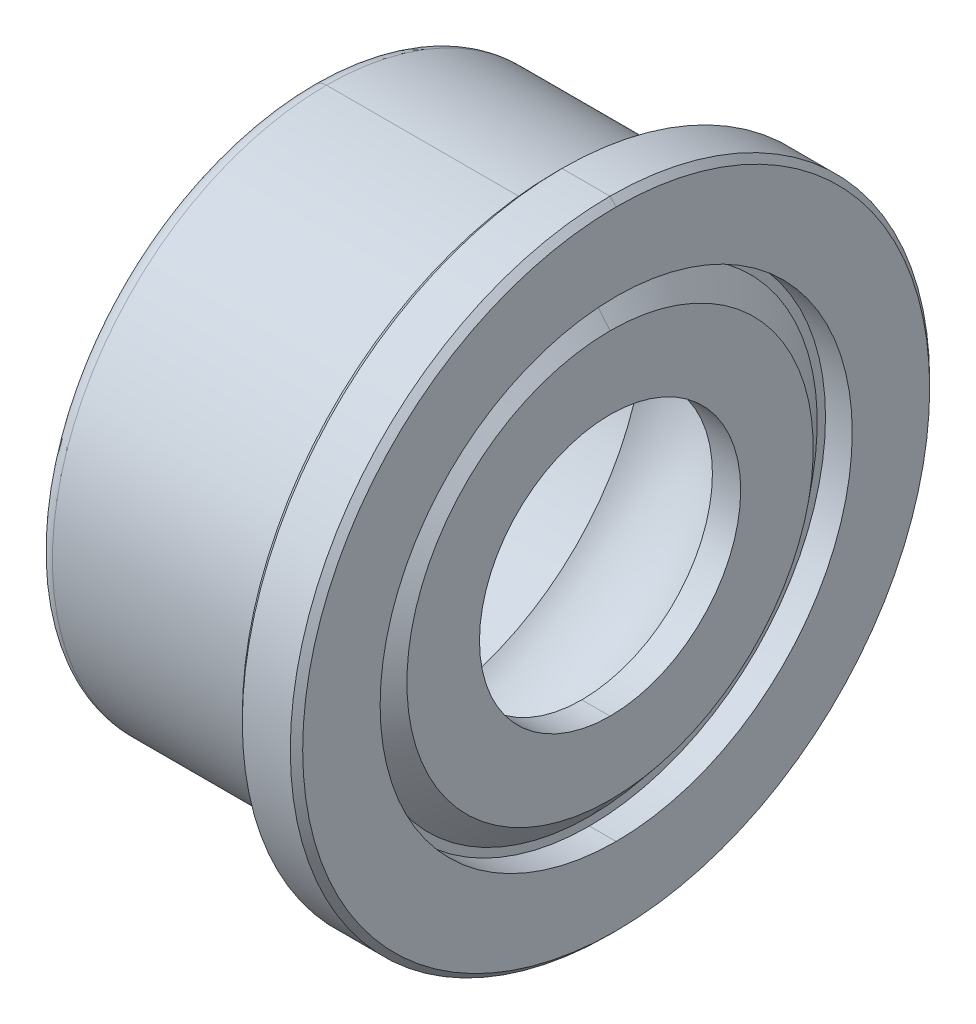
ISO-10303-21;
HEADER;
FILE_DESCRIPTION(('STEP AP214'),'2;1');
FILE_NAME('part.step','',(''),(''),'','','');
FILE_SCHEMA(('AUTOMOTIVE_DESIGN { 1 0 10303 214 1 1 1 1 }'));
ENDSEC;
DATA;
#1=APPLICATION_CONTEXT('core data for automotive mechanical design processes');
#2=APPLICATION_PROTOCOL_DEFINITION('international standard','automotive_design',2000,#1);
#3=PRODUCT_CONTEXT('',#1,'mechanical');
#4=PRODUCT('Part','Part','',(#3));
#5=PRODUCT_RELATED_PRODUCT_CATEGORY('part','',(#4));
#6=PRODUCT_DEFINITION_FORMATION('','',#4);
#7=PRODUCT_DEFINITION_CONTEXT('part definition',#1,'design');
#8=PRODUCT_DEFINITION('design','',#6,#7);
#9=PRODUCT_DEFINITION_SHAPE('','',#8);
#10=(LENGTH_UNIT() NAMED_UNIT(*) SI_UNIT(.MILLI.,.METRE.));
#11=(NAMED_UNIT(*) PLANE_ANGLE_UNIT() SI_UNIT($,.RADIAN.));
#12=(NAMED_UNIT(*) SI_UNIT($,.STERADIAN.) SOLID_ANGLE_UNIT());
#13=UNCERTAINTY_MEASURE_WITH_UNIT(LENGTH_MEASURE(1.E-05),#10,'distance_accuracy_value','');
#14=(GEOMETRIC_REPRESENTATION_CONTEXT(3) GLOBAL_UNCERTAINTY_ASSIGNED_CONTEXT((#13)) GLOBAL_UNIT_ASSIGNED_CONTEXT((#10,
#11,#12)) REPRESENTATION_CONTEXT('',''));
#15=CARTESIAN_POINT('',(0.,0.,0.));
#16=DIRECTION('',(0.,0.,1.));
#17=DIRECTION('',(1.,0.,0.));
#18=AXIS2_PLACEMENT_3D('',#15,#16,#17);
#19=CARTESIAN_POINT('',(-2.75209,0.,0.));
#20=DIRECTION('',(1.,0.,0.));
#21=DIRECTION('',(0.,-1.,0.));
#22=AXIS2_PLACEMENT_3D('',#19,#20,#21);
#23=CYLINDRICAL_SURFACE('',#22,3.872865);
#24=DIRECTION('',(1.,0.,0.));
#25=VECTOR('',#24,1.);
#26=CARTESIAN_POINT('',(0.893356989268567,3.872865,0.));
#27=LINE('',#26,#25);
#28=CARTESIAN_POINT('',(0.893356989268568,3.872865,0.));
#29=VERTEX_POINT('',#28);
#30=CARTESIAN_POINT('',(1.93804322400718,3.872865,0.));
#31=VERTEX_POINT('',#30);
#32=EDGE_CURVE('E19',#29,#31,#27,.T.);
#33=ORIENTED_EDGE('',*,*,#32,.F.);
#34=CARTESIAN_POINT('',(0.893356989268566,0.,0.));
#35=DIRECTION('',(-1.,0.,0.));
#36=DIRECTION('',(0.,1.,0.));
#37=AXIS2_PLACEMENT_3D('',#34,#35,#36);
#38=CIRCLE('',#37,3.872865);
#39=CARTESIAN_POINT('',(0.893356989268568,-3.872865,0.));
#40=VERTEX_POINT('',#39);
#41=EDGE_CURVE('E284',#29,#40,#38,.T.);
#42=ORIENTED_EDGE('',*,*,#41,.T.);
#43=DIRECTION('',(1.,0.,0.));
#44=VECTOR('',#43,1.);
#45=CARTESIAN_POINT('',(0.893356989268567,-3.872865,0.));
#46=LINE('',#45,#44);
#47=CARTESIAN_POINT('',(1.93804322400718,-3.872865,0.));
#48=VERTEX_POINT('',#47);
#49=EDGE_CURVE('E24',#40,#48,#46,.T.);
#50=ORIENTED_EDGE('',*,*,#49,.T.);
#51=CARTESIAN_POINT('',(1.93804322400718,0.,0.));
#52=DIRECTION('',(1.,0.,0.));
#53=DIRECTION('',(0.,-1.,0.));
#54=AXIS2_PLACEMENT_3D('',#51,#52,#53);
#55=CIRCLE('',#54,3.872865);
#56=EDGE_CURVE('E11',#48,#31,#55,.T.);
#57=ORIENTED_EDGE('',*,*,#56,.T.);
#58=EDGE_LOOP('',(#33,#42,#50,#57));
#59=FACE_BOUND('',#58,.T.);
#60=ADVANCED_FACE('F16',(#59),#23,.F.);
#61=CARTESIAN_POINT('',(1.93804322400718,0.,0.));
#62=DIRECTION('',(1.,0.,0.));
#63=DIRECTION('',(0.,-1.,0.));
#64=AXIS2_PLACEMENT_3D('',#61,#62,#63);
#65=PLANE('',#64);
#66=CARTESIAN_POINT('',(1.93804322400718,0.,0.));
#67=DIRECTION('',(-1.,0.,0.));
#68=DIRECTION('',(0.,1.,0.));
#69=AXIS2_PLACEMENT_3D('',#66,#67,#68);
#70=CIRCLE('',#69,2.14275035);
#71=CARTESIAN_POINT('',(1.93804322400718,2.14275035,0.));
#72=VERTEX_POINT('',#71);
#73=CARTESIAN_POINT('',(1.93804322400718,-2.14275035,0.));
#74=VERTEX_POINT('',#73);
#75=EDGE_CURVE('E844',#72,#74,#70,.T.);
#76=ORIENTED_EDGE('',*,*,#75,.F.);
#77=CARTESIAN_POINT('',(1.93804322400718,0.,0.));
#78=DIRECTION('',(1.,0.,0.));
#79=DIRECTION('',(0.,1.,0.));
#80=AXIS2_PLACEMENT_3D('',#77,#78,#79);
#81=CIRCLE('',#80,2.14275035);
#82=EDGE_CURVE('E846',#72,#74,#81,.T.);
#83=ORIENTED_EDGE('',*,*,#82,.T.);
#84=EDGE_LOOP('',(#76,#83));
#85=FACE_BOUND('',#84,.T.);
#86=ORIENTED_EDGE('',*,*,#56,.F.);
#87=CARTESIAN_POINT('',(1.93804322400718,0.,0.));
#88=DIRECTION('',(1.,0.,0.));
#89=DIRECTION('',(0.,1.,0.));
#90=AXIS2_PLACEMENT_3D('',#87,#88,#89);
#91=CIRCLE('',#90,3.872865);
#92=EDGE_CURVE('E293',#31,#48,#91,.T.);
#93=ORIENTED_EDGE('',*,*,#92,.F.);
#94=EDGE_LOOP('',(#86,#93));
#95=FACE_BOUND('',#94,.T.);
#96=ADVANCED_FACE('F335',(#85,#95),#65,.F.);
#97=CARTESIAN_POINT('',(-2.75209,0.,0.));
#98=DIRECTION('',(1.,0.,0.));
#99=DIRECTION('',(0.,-1.,0.));
#100=AXIS2_PLACEMENT_3D('',#97,#98,#99);
#101=CYLINDRICAL_SURFACE('',#100,3.872865);
#102=ORIENTED_EDGE('',*,*,#49,.F.);
#103=CARTESIAN_POINT('',(0.893356989268566,0.,0.));
#104=DIRECTION('',(1.,0.,0.));
#105=DIRECTION('',(0.,1.,0.));
#106=AXIS2_PLACEMENT_3D('',#103,#104,#105);
#107=CIRCLE('',#106,3.872865);
#108=EDGE_CURVE('E288',#29,#40,#107,.T.);
#109=ORIENTED_EDGE('',*,*,#108,.F.);
#110=ORIENTED_EDGE('',*,*,#32,.T.);
#111=ORIENTED_EDGE('',*,*,#92,.T.);
#112=EDGE_LOOP('',(#102,#109,#110,#111));
#113=FACE_BOUND('',#112,.T.);
#114=ADVANCED_FACE('F307',(#113),#101,.F.);
#115=CARTESIAN_POINT('',(0.,0.,0.));
#116=DIRECTION('',(1.,0.,0.));
#117=DIRECTION('',(0.,-1.,0.));
#118=AXIS2_PLACEMENT_3D('',#115,#116,#117);
#119=TOROIDAL_SURFACE('',#118,2.9972,1.25095);
#120=ORIENTED_EDGE('',*,*,#108,.T.);
#121=CARTESIAN_POINT('',(0.,-2.9972,0.));
#122=DIRECTION('',(0.,0.,1.));
#123=DIRECTION('',(-0.714142842854285,-0.7,0.));
#124=AXIS2_PLACEMENT_3D('',#121,#122,#123);
#125=CIRCLE('',#124,1.25095);
#126=CARTESIAN_POINT('',(-0.893356989268568,-3.872865,0.));
#127=VERTEX_POINT('',#126);
#128=EDGE_CURVE('E285',#127,#40,#125,.T.);
#129=ORIENTED_EDGE('',*,*,#128,.F.);
#130=CARTESIAN_POINT('',(-0.893356989268568,0.,0.));
#131=DIRECTION('',(1.,0.,0.));
#132=DIRECTION('',(0.,1.,0.));
#133=AXIS2_PLACEMENT_3D('',#130,#131,#132);
#134=CIRCLE('',#133,3.872865);
#135=CARTESIAN_POINT('',(-0.893356989268568,3.872865,0.));
#136=VERTEX_POINT('',#135);
#137=EDGE_CURVE('E278',#136,#127,#134,.T.);
#138=ORIENTED_EDGE('',*,*,#137,.F.);
#139=CARTESIAN_POINT('',(0.,2.9972,0.));
#140=DIRECTION('',(0.,0.,-1.));
#141=DIRECTION('',(-0.714142842854285,0.7,0.));
#142=AXIS2_PLACEMENT_3D('',#139,#140,#141);
#143=CIRCLE('',#142,1.25095);
#144=EDGE_CURVE('E281',#136,#29,#143,.T.);
#145=ORIENTED_EDGE('',*,*,#144,.T.);
#146=EDGE_LOOP('',(#120,#129,#138,#145));
#147=FACE_BOUND('',#146,.T.);
#148=ADVANCED_FACE('F310',(#147),#119,.F.);
#149=CARTESIAN_POINT('',(0.,0.,0.));
#150=DIRECTION('',(1.,0.,0.));
#151=DIRECTION('',(0.,-1.,0.));
#152=AXIS2_PLACEMENT_3D('',#149,#150,#151);
#153=TOROIDAL_SURFACE('',#152,2.9972,1.25095);
#154=CARTESIAN_POINT('',(-0.893356989268568,0.,0.));
#155=DIRECTION('',(-1.,0.,0.));
#156=DIRECTION('',(0.,1.,0.));
#157=AXIS2_PLACEMENT_3D('',#154,#155,#156);
#158=CIRCLE('',#157,3.872865);
#159=EDGE_CURVE('E277',#136,#127,#158,.T.);
#160=ORIENTED_EDGE('',*,*,#159,.T.);
#161=ORIENTED_EDGE('',*,*,#128,.T.);
#162=ORIENTED_EDGE('',*,*,#41,.F.);
#163=ORIENTED_EDGE('',*,*,#144,.F.);
#164=EDGE_LOOP('',(#160,#161,#162,#163));
#165=FACE_BOUND('',#164,.T.);
#166=ADVANCED_FACE('F311',(#165),#153,.F.);
#167=CARTESIAN_POINT('',(-2.75209,0.,0.));
#168=DIRECTION('',(1.,0.,0.));
#169=DIRECTION('',(0.,-1.,0.));
#170=AXIS2_PLACEMENT_3D('',#167,#168,#169);
#171=CYLINDRICAL_SURFACE('',#170,3.872865);
#172=DIRECTION('',(1.,0.,0.));
#173=VECTOR('',#172,1.);
#174=CARTESIAN_POINT('',(-1.93804322400718,-3.872865,0.));
#175=LINE('',#174,#173);
#176=CARTESIAN_POINT('',(-1.93804322400718,-3.872865,0.));
#177=VERTEX_POINT('',#176);
#178=EDGE_CURVE('E273',#177,#127,#175,.T.);
#179=ORIENTED_EDGE('',*,*,#178,.T.);
#180=ORIENTED_EDGE('',*,*,#159,.F.);
#181=DIRECTION('',(1.,0.,0.));
#182=VECTOR('',#181,1.);
#183=CARTESIAN_POINT('',(-1.93804322400718,3.872865,0.));
#184=LINE('',#183,#182);
#185=CARTESIAN_POINT('',(-1.93804322400718,3.872865,0.));
#186=VERTEX_POINT('',#185);
#187=EDGE_CURVE('E274',#186,#136,#184,.T.);
#188=ORIENTED_EDGE('',*,*,#187,.F.);
#189=CARTESIAN_POINT('',(-1.93804322400718,0.,0.));
#190=DIRECTION('',(1.,0.,0.));
#191=DIRECTION('',(0.,-1.,0.));
#192=AXIS2_PLACEMENT_3D('',#189,#190,#191);
#193=CIRCLE('',#192,3.872865);
#194=EDGE_CURVE('E270',#177,#186,#193,.T.);
#195=ORIENTED_EDGE('',*,*,#194,.F.);
#196=EDGE_LOOP('',(#179,#180,#188,#195));
#197=FACE_BOUND('',#196,.T.);
#198=ADVANCED_FACE('F315',(#197),#171,.F.);
#199=CARTESIAN_POINT('',(-2.75209,0.,0.));
#200=DIRECTION('',(1.,0.,0.));
#201=DIRECTION('',(0.,-1.,0.));
#202=AXIS2_PLACEMENT_3D('',#199,#200,#201);
#203=CYLINDRICAL_SURFACE('',#202,3.872865);
#204=ORIENTED_EDGE('',*,*,#187,.T.);
#205=ORIENTED_EDGE('',*,*,#137,.T.);
#206=ORIENTED_EDGE('',*,*,#178,.F.);
#207=CARTESIAN_POINT('',(-1.93804322400718,0.,0.));
#208=DIRECTION('',(1.,0.,0.));
#209=DIRECTION('',(0.,1.,0.));
#210=AXIS2_PLACEMENT_3D('',#207,#208,#209);
#211=CIRCLE('',#210,3.872865);
#212=EDGE_CURVE('E265',#186,#177,#211,.T.);
#213=ORIENTED_EDGE('',*,*,#212,.F.);
#214=EDGE_LOOP('',(#204,#205,#206,#213));
#215=FACE_BOUND('',#214,.T.);
#216=ADVANCED_FACE('F318',(#215),#203,.F.);
#217=CARTESIAN_POINT('',(-1.93804322400718,0.,0.));
#218=DIRECTION('',(1.,0.,0.));
#219=DIRECTION('',(0.,-1.,0.));
#220=AXIS2_PLACEMENT_3D('',#217,#218,#219);
#221=PLANE('',#220);
#222=CARTESIAN_POINT('',(-1.93804322400718,0.,0.));
#223=DIRECTION('',(1.,0.,0.));
#224=DIRECTION('',(0.,1.,0.));
#225=AXIS2_PLACEMENT_3D('',#222,#223,#224);
#226=CIRCLE('',#225,2.14275035);
#227=CARTESIAN_POINT('',(-1.93804322400718,2.14275035,0.));
#228=VERTEX_POINT('',#227);
#229=CARTESIAN_POINT('',(-1.93804322400718,-2.14275035,0.));
#230=VERTEX_POINT('',#229);
#231=EDGE_CURVE('E261',#228,#230,#226,.T.);
#232=ORIENTED_EDGE('',*,*,#231,.F.);
#233=CARTESIAN_POINT('',(-1.93804322400718,0.,0.));
#234=DIRECTION('',(-1.,0.,0.));
#235=DIRECTION('',(0.,1.,0.));
#236=AXIS2_PLACEMENT_3D('',#233,#234,#235);
#237=CIRCLE('',#236,2.14275035);
#238=EDGE_CURVE('E263',#228,#230,#237,.T.);
#239=ORIENTED_EDGE('',*,*,#238,.T.);
#240=EDGE_LOOP('',(#232,#239));
#241=FACE_BOUND('',#240,.T.);
#242=ORIENTED_EDGE('',*,*,#194,.T.);
#243=ORIENTED_EDGE('',*,*,#212,.T.);
#244=EDGE_LOOP('',(#242,#243));
#245=FACE_BOUND('',#244,.T.);
#246=ADVANCED_FACE('F320',(#241,#245),#221,.T.);
#247=CARTESIAN_POINT('',(-2.6420064,0.,0.));
#248=DIRECTION('',(1.,0.,0.));
#249=DIRECTION('',(0.,-1.,0.));
#250=AXIS2_PLACEMENT_3D('',#247,#248,#249);
#251=CYLINDRICAL_SURFACE('',#250,2.14275035);
#252=CARTESIAN_POINT('',(-2.401824,0.,0.));
#253=DIRECTION('',(-1.,0.,0.));
#254=DIRECTION('',(0.,1.,0.));
#255=AXIS2_PLACEMENT_3D('',#252,#253,#254);
#256=CIRCLE('',#255,2.14275035);
#257=CARTESIAN_POINT('',(-2.401824,2.14275035,0.));
#258=VERTEX_POINT('',#257);
#259=CARTESIAN_POINT('',(-2.401824,-2.14275035,0.));
#260=VERTEX_POINT('',#259);
#261=EDGE_CURVE('E254',#258,#260,#256,.T.);
#262=ORIENTED_EDGE('',*,*,#261,.T.);
#263=DIRECTION('',(1.,0.,0.));
#264=VECTOR('',#263,1.);
#265=CARTESIAN_POINT('',(-2.401824,-2.14275035,0.));
#266=LINE('',#265,#264);
#267=EDGE_CURVE('E258',#260,#230,#266,.T.);
#268=ORIENTED_EDGE('',*,*,#267,.T.);
#269=ORIENTED_EDGE('',*,*,#238,.F.);
#270=DIRECTION('',(1.,0.,0.));
#271=VECTOR('',#270,1.);
#272=CARTESIAN_POINT('',(-2.401824,2.14275035,0.));
#273=LINE('',#272,#271);
#274=EDGE_CURVE('E255',#258,#228,#273,.T.);
#275=ORIENTED_EDGE('',*,*,#274,.F.);
#276=EDGE_LOOP('',(#262,#268,#269,#275));
#277=FACE_BOUND('',#276,.T.);
#278=ADVANCED_FACE('F322',(#277),#251,.F.);
#279=CARTESIAN_POINT('',(-2.6420064,0.,0.));
#280=DIRECTION('',(1.,0.,0.));
#281=DIRECTION('',(0.,-1.,0.));
#282=AXIS2_PLACEMENT_3D('',#279,#280,#281);
#283=CYLINDRICAL_SURFACE('',#282,2.14275035);
#284=ORIENTED_EDGE('',*,*,#231,.T.);
#285=ORIENTED_EDGE('',*,*,#267,.F.);
#286=CARTESIAN_POINT('',(-2.401824,0.,0.));
#287=DIRECTION('',(1.,0.,0.));
#288=DIRECTION('',(0.,1.,0.));
#289=AXIS2_PLACEMENT_3D('',#286,#287,#288);
#290=CIRCLE('',#289,2.14275035);
#291=EDGE_CURVE('E249',#258,#260,#290,.T.);
#292=ORIENTED_EDGE('',*,*,#291,.F.);
#293=ORIENTED_EDGE('',*,*,#274,.T.);
#294=EDGE_LOOP('',(#284,#285,#292,#293));
#295=FACE_BOUND('',#294,.T.);
#296=ADVANCED_FACE('F330',(#295),#283,.F.);
#297=CARTESIAN_POINT('',(-2.401824,0.,0.));
#298=DIRECTION('',(1.,0.,0.));
#299=DIRECTION('',(0.,-1.,0.));
#300=AXIS2_PLACEMENT_3D('',#297,#298,#299);
#301=PLANE('',#300);
#302=ORIENTED_EDGE('',*,*,#261,.F.);
#303=ORIENTED_EDGE('',*,*,#291,.T.);
#304=EDGE_LOOP('',(#302,#303));
#305=FACE_BOUND('',#304,.T.);
#306=CARTESIAN_POINT('',(-2.401824,0.,0.));
#307=DIRECTION('',(1.,0.,0.));
#308=DIRECTION('',(0.,1.,0.));
#309=AXIS2_PLACEMENT_3D('',#306,#307,#308);
#310=CIRCLE('',#309,3.3336847347);
#311=CARTESIAN_POINT('',(-2.401824,3.3336847347,0.));
#312=VERTEX_POINT('',#311);
#313=CARTESIAN_POINT('',(-2.401824,-3.3336847347,0.));
#314=VERTEX_POINT('',#313);
#315=EDGE_CURVE('E245',#312,#314,#310,.T.);
#316=ORIENTED_EDGE('',*,*,#315,.F.);
#317=CARTESIAN_POINT('',(-2.401824,0.,0.));
#318=DIRECTION('',(-1.,0.,0.));
#319=DIRECTION('',(0.,1.,0.));
#320=AXIS2_PLACEMENT_3D('',#317,#318,#319);
#321=CIRCLE('',#320,3.3336847347);
#322=EDGE_CURVE('E247',#312,#314,#321,.T.);
#323=ORIENTED_EDGE('',*,*,#322,.T.);
#324=EDGE_LOOP('',(#316,#323));
#325=FACE_BOUND('',#324,.T.);
#326=ADVANCED_FACE('F386',(#305,#325),#301,.F.);
#327=CARTESIAN_POINT('',(-2.41390058018481,0.,0.));
#328=DIRECTION('',(1.,0.,0.));
#329=DIRECTION('',(0.,-1.,0.));
#330=AXIS2_PLACEMENT_3D('',#327,#328,#329);
#331=CONICAL_SURFACE('',#330,3.3192924268785,0.872664625997165);
#332=CARTESIAN_POINT('',(-2.06313822400718,0.,0.));
#333=DIRECTION('',(-1.,0.,0.));
#334=DIRECTION('',(0.,1.,0.));
#335=AXIS2_PLACEMENT_3D('',#332,#333,#334);
#336=CIRCLE('',#335,3.737314725);
#337=CARTESIAN_POINT('',(-2.06313822400718,3.737314725,0.));
#338=VERTEX_POINT('',#337);
#339=CARTESIAN_POINT('',(-2.06313822400718,-3.737314725,0.));
#340=VERTEX_POINT('',#339);
#341=EDGE_CURVE('E238',#338,#340,#336,.T.);
#342=ORIENTED_EDGE('',*,*,#341,.T.);
#343=DIRECTION('',(-0.642787609686539,0.766044443118978,0.));
#344=VECTOR('',#343,1.);
#345=CARTESIAN_POINT('',(-2.06313822400718,-3.737314725,0.));
#346=LINE('',#345,#344);
#347=EDGE_CURVE('E242',#340,#314,#346,.T.);
#348=ORIENTED_EDGE('',*,*,#347,.T.);
#349=ORIENTED_EDGE('',*,*,#322,.F.);
#350=DIRECTION('',(-0.642787609686539,-0.766044443118978,0.));
#351=VECTOR('',#350,1.);
#352=CARTESIAN_POINT('',(-2.06313822400718,3.737314725,0.));
#353=LINE('',#352,#351);
#354=EDGE_CURVE('E239',#338,#312,#353,.T.);
#355=ORIENTED_EDGE('',*,*,#354,.F.);
#356=EDGE_LOOP('',(#342,#348,#349,#355));
#357=FACE_BOUND('',#356,.T.);
#358=ADVANCED_FACE('F397',(#357),#331,.T.);
#359=CARTESIAN_POINT('',(-2.41390058018481,0.,0.));
#360=DIRECTION('',(1.,0.,0.));
#361=DIRECTION('',(0.,-1.,0.));
#362=AXIS2_PLACEMENT_3D('',#359,#360,#361);
#363=CONICAL_SURFACE('',#362,3.3192924268785,0.872664625997165);
#364=ORIENTED_EDGE('',*,*,#315,.T.);
#365=ORIENTED_EDGE('',*,*,#347,.F.);
#366=CARTESIAN_POINT('',(-2.06313822400718,0.,0.));
#367=DIRECTION('',(1.,0.,0.));
#368=DIRECTION('',(0.,1.,0.));
#369=AXIS2_PLACEMENT_3D('',#366,#367,#368);
#370=CIRCLE('',#369,3.737314725);
#371=EDGE_CURVE('E230',#338,#340,#370,.T.);
#372=ORIENTED_EDGE('',*,*,#371,.F.);
#373=ORIENTED_EDGE('',*,*,#354,.T.);
#374=EDGE_LOOP('',(#364,#365,#372,#373));
#375=FACE_BOUND('',#374,.T.);
#376=ADVANCED_FACE('F408',(#375),#363,.T.);
#377=CARTESIAN_POINT('',(-2.75209,0.,0.));
#378=DIRECTION('',(1.,0.,0.));
#379=DIRECTION('',(0.,-1.,0.));
#380=AXIS2_PLACEMENT_3D('',#377,#378,#379);
#381=CYLINDRICAL_SURFACE('',#380,3.872865);
#382=DIRECTION('',(1.,0.,0.));
#383=VECTOR('',#382,1.);
#384=CARTESIAN_POINT('',(-2.5019,3.872865,0.));
#385=LINE('',#384,#383);
#386=CARTESIAN_POINT('',(-2.5019,3.872865,0.));
#387=VERTEX_POINT('',#386);
#388=CARTESIAN_POINT('',(-2.06313822400718,3.872865,0.));
#389=VERTEX_POINT('',#388);
#390=EDGE_CURVE('E224',#387,#389,#385,.T.);
#391=ORIENTED_EDGE('',*,*,#390,.F.);
#392=CARTESIAN_POINT('',(-2.5019,0.,0.));
#393=DIRECTION('',(-1.,0.,0.));
#394=DIRECTION('',(0.,1.,0.));
#395=AXIS2_PLACEMENT_3D('',#392,#393,#394);
#396=CIRCLE('',#395,3.872865);
#397=CARTESIAN_POINT('',(-2.5019,-3.872865,0.));
#398=VERTEX_POINT('',#397);
#399=EDGE_CURVE('E225',#387,#398,#396,.T.);
#400=ORIENTED_EDGE('',*,*,#399,.T.);
#401=DIRECTION('',(1.,0.,0.));
#402=VECTOR('',#401,1.);
#403=CARTESIAN_POINT('',(-2.5019,-3.872865,0.));
#404=LINE('',#403,#402);
#405=CARTESIAN_POINT('',(-2.06313822400718,-3.872865,0.));
#406=VERTEX_POINT('',#405);
#407=EDGE_CURVE('E231',#398,#406,#404,.T.);
#408=ORIENTED_EDGE('',*,*,#407,.T.);
#409=CARTESIAN_POINT('',(-2.06313822400718,0.,0.));
#410=DIRECTION('',(1.,0.,0.));
#411=DIRECTION('',(0.,-1.,0.));
#412=AXIS2_PLACEMENT_3D('',#409,#410,#411);
#413=CIRCLE('',#412,3.872865);
#414=EDGE_CURVE('E228',#406,#389,#413,.T.);
#415=ORIENTED_EDGE('',*,*,#414,.T.);
#416=EDGE_LOOP('',(#391,#400,#408,#415));
#417=FACE_BOUND('',#416,.T.);
#418=ADVANCED_FACE('F419',(#417),#381,.F.);
#419=CARTESIAN_POINT('',(-2.06313822400718,0.,0.));
#420=DIRECTION('',(1.,0.,0.));
#421=DIRECTION('',(0.,-1.,0.));
#422=AXIS2_PLACEMENT_3D('',#419,#420,#421);
#423=PLANE('',#422);
#424=ORIENTED_EDGE('',*,*,#341,.F.);
#425=ORIENTED_EDGE('',*,*,#371,.T.);
#426=EDGE_LOOP('',(#424,#425));
#427=FACE_BOUND('',#426,.T.);
#428=ORIENTED_EDGE('',*,*,#414,.F.);
#429=CARTESIAN_POINT('',(-2.06313822400718,0.,0.));
#430=DIRECTION('',(1.,0.,0.));
#431=DIRECTION('',(0.,1.,0.));
#432=AXIS2_PLACEMENT_3D('',#429,#430,#431);
#433=CIRCLE('',#432,3.872865);
#434=EDGE_CURVE('E221',#389,#406,#433,.T.);
#435=ORIENTED_EDGE('',*,*,#434,.F.);
#436=EDGE_LOOP('',(#428,#435));
#437=FACE_BOUND('',#436,.T.);
#438=ADVANCED_FACE('F430',(#427,#437),#423,.F.);
#439=CARTESIAN_POINT('',(-2.75209,0.,0.));
#440=DIRECTION('',(1.,0.,0.));
#441=DIRECTION('',(0.,-1.,0.));
#442=AXIS2_PLACEMENT_3D('',#439,#440,#441);
#443=CYLINDRICAL_SURFACE('',#442,3.872865);
#444=ORIENTED_EDGE('',*,*,#407,.F.);
#445=CARTESIAN_POINT('',(-2.5019,0.,0.));
#446=DIRECTION('',(1.,0.,0.));
#447=DIRECTION('',(0.,1.,0.));
#448=AXIS2_PLACEMENT_3D('',#445,#446,#447);
#449=CIRCLE('',#448,3.872865);
#450=EDGE_CURVE('E220',#387,#398,#449,.T.);
#451=ORIENTED_EDGE('',*,*,#450,.F.);
#452=ORIENTED_EDGE('',*,*,#390,.T.);
#453=ORIENTED_EDGE('',*,*,#434,.T.);
#454=EDGE_LOOP('',(#444,#451,#452,#453));
#455=FACE_BOUND('',#454,.T.);
#456=ADVANCED_FACE('F441',(#455),#443,.F.);
#457=CARTESIAN_POINT('',(-2.5019,0.,0.));
#458=DIRECTION('',(1.,0.,0.));
#459=DIRECTION('',(0.,-1.,0.));
#460=AXIS2_PLACEMENT_3D('',#457,#458,#459);
#461=PLANE('',#460);
#462=ORIENTED_EDGE('',*,*,#399,.F.);
#463=ORIENTED_EDGE('',*,*,#450,.T.);
#464=EDGE_LOOP('',(#462,#463));
#465=FACE_BOUND('',#464,.T.);
#466=CARTESIAN_POINT('',(-2.5019,0.,0.));
#467=DIRECTION('',(1.,0.,0.));
#468=DIRECTION('',(0.,1.,0.));
#469=AXIS2_PLACEMENT_3D('',#466,#467,#468);
#470=CIRCLE('',#469,4.24561);
#471=CARTESIAN_POINT('',(-2.5019,4.24561,0.));
#472=VERTEX_POINT('',#471);
#473=CARTESIAN_POINT('',(-2.5019,-4.24561,0.));
#474=VERTEX_POINT('',#473);
#475=EDGE_CURVE('E216',#472,#474,#470,.T.);
#476=ORIENTED_EDGE('',*,*,#475,.F.);
#477=CARTESIAN_POINT('',(-2.5019,0.,0.));
#478=DIRECTION('',(-1.,0.,0.));
#479=DIRECTION('',(0.,1.,0.));
#480=AXIS2_PLACEMENT_3D('',#477,#478,#479);
#481=CIRCLE('',#480,4.24561);
#482=EDGE_CURVE('E195',#472,#474,#481,.T.);
#483=ORIENTED_EDGE('',*,*,#482,.T.);
#484=EDGE_LOOP('',(#476,#483));
#485=FACE_BOUND('',#484,.T.);
#486=ADVANCED_FACE('F452',(#465,#485),#461,.F.);
#487=CARTESIAN_POINT('',(-2.25171,0.,0.));
#488=DIRECTION('',(1.,0.,0.));
#489=DIRECTION('',(0.,-1.,0.));
#490=AXIS2_PLACEMENT_3D('',#487,#488,#489);
#491=TOROIDAL_SURFACE('',#490,4.24561,0.25019);
#492=ORIENTED_EDGE('',*,*,#475,.T.);
#493=CARTESIAN_POINT('',(-2.25171,-4.24561,0.));
#494=DIRECTION('',(0.,0.,-1.));
#495=DIRECTION('',(0.,-1.,0.));
#496=AXIS2_PLACEMENT_3D('',#493,#494,#495);
#497=CIRCLE('',#496,0.25019);
#498=CARTESIAN_POINT('',(-2.25171,-4.4958,0.));
#499=VERTEX_POINT('',#498);
#500=EDGE_CURVE('E182',#499,#474,#497,.T.);
#501=ORIENTED_EDGE('',*,*,#500,.F.);
#502=CARTESIAN_POINT('',(-2.25171,0.,0.));
#503=DIRECTION('',(1.,0.,0.));
#504=DIRECTION('',(0.,1.,0.));
#505=AXIS2_PLACEMENT_3D('',#502,#503,#504);
#506=CIRCLE('',#505,4.4958);
#507=CARTESIAN_POINT('',(-2.25171,4.4958,0.));
#508=VERTEX_POINT('',#507);
#509=EDGE_CURVE('E175',#508,#499,#506,.T.);
#510=ORIENTED_EDGE('',*,*,#509,.F.);
#511=CARTESIAN_POINT('',(-2.25171,4.24561,0.));
#512=DIRECTION('',(0.,0.,1.));
#513=DIRECTION('',(0.,1.,0.));
#514=AXIS2_PLACEMENT_3D('',#511,#512,#513);
#515=CIRCLE('',#514,0.25019);
#516=EDGE_CURVE('E179',#508,#472,#515,.T.);
#517=ORIENTED_EDGE('',*,*,#516,.T.);
#518=EDGE_LOOP('',(#492,#501,#510,#517));
#519=FACE_BOUND('',#518,.T.);
#520=ADVANCED_FACE('F178',(#519),#491,.T.);
#521=CARTESIAN_POINT('',(-2.25171,0.,0.));
#522=DIRECTION('',(1.,0.,0.));
#523=DIRECTION('',(0.,-1.,0.));
#524=AXIS2_PLACEMENT_3D('',#521,#522,#523);
#525=TOROIDAL_SURFACE('',#524,4.24561,0.25019);
#526=CARTESIAN_POINT('',(-2.25171,0.,0.));
#527=DIRECTION('',(-1.,0.,0.));
#528=DIRECTION('',(0.,1.,0.));
#529=AXIS2_PLACEMENT_3D('',#526,#527,#528);
#530=CIRCLE('',#529,4.4958);
#531=EDGE_CURVE('E193',#508,#499,#530,.T.);
#532=ORIENTED_EDGE('',*,*,#531,.T.);
#533=ORIENTED_EDGE('',*,*,#500,.T.);
#534=ORIENTED_EDGE('',*,*,#482,.F.);
#535=ORIENTED_EDGE('',*,*,#516,.F.);
#536=EDGE_LOOP('',(#532,#533,#534,#535));
#537=FACE_BOUND('',#536,.T.);
#538=ADVANCED_FACE('F192',(#537),#525,.T.);
#539=CARTESIAN_POINT('',(1.3462,0.,0.));
#540=DIRECTION('',(1.,0.,0.));
#541=DIRECTION('',(0.,-1.,0.));
#542=AXIS2_PLACEMENT_3D('',#539,#540,#541);
#543=TOROIDAL_SURFACE('',#542,4.6609,0.1651);
#544=CARTESIAN_POINT('',(1.3462,4.6609,0.));
#545=DIRECTION('',(0.,0.,-1.));
#546=DIRECTION('',(1.,0.,0.));
#547=AXIS2_PLACEMENT_3D('',#544,#545,#546);
#548=CIRCLE('',#547,0.1651);
#549=CARTESIAN_POINT('',(1.5113,4.6609,0.));
#550=VERTEX_POINT('',#549);
#551=CARTESIAN_POINT('',(1.3462,4.4958,0.));
#552=VERTEX_POINT('',#551);
#553=EDGE_CURVE('E211',#550,#552,#548,.T.);
#554=ORIENTED_EDGE('',*,*,#553,.F.);
#555=CARTESIAN_POINT('',(1.5113,0.,0.));
#556=DIRECTION('',(-1.,0.,0.));
#557=DIRECTION('',(0.,1.,0.));
#558=AXIS2_PLACEMENT_3D('',#555,#556,#557);
#559=CIRCLE('',#558,4.6609);
#560=CARTESIAN_POINT('',(1.5113,-4.6609,0.));
#561=VERTEX_POINT('',#560);
#562=EDGE_CURVE('E212',#550,#561,#559,.T.);
#563=ORIENTED_EDGE('',*,*,#562,.T.);
#564=CARTESIAN_POINT('',(1.3462,-4.6609,0.));
#565=DIRECTION('',(0.,0.,1.));
#566=DIRECTION('',(1.,0.,0.));
#567=AXIS2_PLACEMENT_3D('',#564,#565,#566);
#568=CIRCLE('',#567,0.1651);
#569=CARTESIAN_POINT('',(1.3462,-4.4958,0.));
#570=VERTEX_POINT('',#569);
#571=EDGE_CURVE('E32',#561,#570,#568,.T.);
#572=ORIENTED_EDGE('',*,*,#571,.T.);
#573=CARTESIAN_POINT('',(1.3462,0.,0.));
#574=DIRECTION('',(1.,0.,0.));
#575=DIRECTION('',(0.,-1.,0.));
#576=AXIS2_PLACEMENT_3D('',#573,#574,#575);
#577=CIRCLE('',#576,4.4958);
#578=EDGE_CURVE('E36',#570,#552,#577,.T.);
#579=ORIENTED_EDGE('',*,*,#578,.T.);
#580=EDGE_LOOP('',(#554,#563,#572,#579));
#581=FACE_BOUND('',#580,.T.);
#582=ADVANCED_FACE('F482',(#581),#543,.F.);
#583=CARTESIAN_POINT('',(-2.75209,0.,0.));
#584=DIRECTION('',(1.,0.,0.));
#585=DIRECTION('',(0.,-1.,0.));
#586=AXIS2_PLACEMENT_3D('',#583,#584,#585);
#587=CYLINDRICAL_SURFACE('',#586,4.4958);
#588=DIRECTION('',(-1.,0.,0.));
#589=VECTOR('',#588,1.);
#590=CARTESIAN_POINT('',(1.3462,-4.4958,0.));
#591=LINE('',#590,#589);
#592=EDGE_CURVE('E188',#570,#499,#591,.T.);
#593=ORIENTED_EDGE('',*,*,#592,.T.);
#594=ORIENTED_EDGE('',*,*,#531,.F.);
#595=DIRECTION('',(-1.,0.,0.));
#596=VECTOR('',#595,1.);
#597=CARTESIAN_POINT('',(1.3462,4.4958,0.));
#598=LINE('',#597,#596);
#599=EDGE_CURVE('E187',#552,#508,#598,.T.);
#600=ORIENTED_EDGE('',*,*,#599,.F.);
#601=ORIENTED_EDGE('',*,*,#578,.F.);
#602=EDGE_LOOP('',(#593,#594,#600,#601));
#603=FACE_BOUND('',#602,.T.);
#604=ADVANCED_FACE('F198',(#603),#587,.T.);
#605=CARTESIAN_POINT('',(-2.75209,0.,0.));
#606=DIRECTION('',(1.,0.,0.));
#607=DIRECTION('',(0.,-1.,0.));
#608=AXIS2_PLACEMENT_3D('',#605,#606,#607);
#609=CYLINDRICAL_SURFACE('',#608,4.4958);
#610=ORIENTED_EDGE('',*,*,#599,.T.);
#611=ORIENTED_EDGE('',*,*,#509,.T.);
#612=ORIENTED_EDGE('',*,*,#592,.F.);
#613=CARTESIAN_POINT('',(1.3462,0.,0.));
#614=DIRECTION('',(1.,0.,0.));
#615=DIRECTION('',(0.,1.,0.));
#616=AXIS2_PLACEMENT_3D('',#613,#614,#615);
#617=CIRCLE('',#616,4.4958);
#618=EDGE_CURVE('E203',#552,#570,#617,.T.);
#619=ORIENTED_EDGE('',*,*,#618,.F.);
#620=EDGE_LOOP('',(#610,#611,#612,#619));
#621=FACE_BOUND('',#620,.T.);
#622=ADVANCED_FACE('F201',(#621),#609,.T.);
#623=CARTESIAN_POINT('',(1.3462,0.,0.));
#624=DIRECTION('',(1.,0.,0.));
#625=DIRECTION('',(0.,-1.,0.));
#626=AXIS2_PLACEMENT_3D('',#623,#624,#625);
#627=TOROIDAL_SURFACE('',#626,4.6609,0.1651);
#628=ORIENTED_EDGE('',*,*,#571,.F.);
#629=CARTESIAN_POINT('',(1.5113,0.,0.));
#630=DIRECTION('',(1.,0.,0.));
#631=DIRECTION('',(0.,1.,0.));
#632=AXIS2_PLACEMENT_3D('',#629,#630,#631);
#633=CIRCLE('',#632,4.6609);
#634=EDGE_CURVE('E214',#550,#561,#633,.T.);
#635=ORIENTED_EDGE('',*,*,#634,.F.);
#636=ORIENTED_EDGE('',*,*,#553,.T.);
#637=ORIENTED_EDGE('',*,*,#618,.T.);
#638=EDGE_LOOP('',(#628,#635,#636,#637));
#639=FACE_BOUND('',#638,.T.);
#640=ADVANCED_FACE('F510',(#639),#627,.F.);
#641=CARTESIAN_POINT('',(1.5113,0.,0.));
#642=DIRECTION('',(1.,0.,0.));
#643=DIRECTION('',(0.,-1.,0.));
#644=AXIS2_PLACEMENT_3D('',#641,#642,#643);
#645=PLANE('',#644);
#646=ORIENTED_EDGE('',*,*,#562,.F.);
#647=ORIENTED_EDGE('',*,*,#634,.T.);
#648=EDGE_LOOP('',(#646,#647));
#649=FACE_BOUND('',#648,.T.);
#650=CARTESIAN_POINT('',(1.5113,0.,0.));
#651=DIRECTION('',(1.,0.,0.));
#652=DIRECTION('',(0.,1.,0.));
#653=AXIS2_PLACEMENT_3D('',#650,#651,#652);
#654=CIRCLE('',#653,5.1435);
#655=CARTESIAN_POINT('',(1.5113,5.1435,0.));
#656=VERTEX_POINT('',#655);
#657=CARTESIAN_POINT('',(1.5113,-5.1435,0.));
#658=VERTEX_POINT('',#657);
#659=EDGE_CURVE('E916',#656,#658,#654,.T.);
#660=ORIENTED_EDGE('',*,*,#659,.F.);
#661=CARTESIAN_POINT('',(1.5113,0.,0.));
#662=DIRECTION('',(-1.,0.,0.));
#663=DIRECTION('',(0.,1.,0.));
#664=AXIS2_PLACEMENT_3D('',#661,#662,#663);
#665=CIRCLE('',#664,5.1435);
#666=EDGE_CURVE('E918',#656,#658,#665,.T.);
#667=ORIENTED_EDGE('',*,*,#666,.T.);
#668=EDGE_LOOP('',(#660,#667));
#669=FACE_BOUND('',#668,.T.);
#670=ADVANCED_FACE('F520',(#649,#669),#645,.F.);
#671=CARTESIAN_POINT('',(1.49801500257078,0.,0.));
#672=DIRECTION('',(1.,0.,0.));
#673=DIRECTION('',(0.,-1.,0.));
#674=AXIS2_PLACEMENT_3D('',#671,#672,#673);
#675=CONICAL_SURFACE('',#674,5.13021500257078,0.785398163397446);
#676=CARTESIAN_POINT('',(1.6129,0.,0.));
#677=DIRECTION('',(-1.,0.,0.));
#678=DIRECTION('',(0.,1.,0.));
#679=AXIS2_PLACEMENT_3D('',#676,#677,#678);
#680=CIRCLE('',#679,5.2451);
#681=CARTESIAN_POINT('',(1.6129,5.2451,0.));
#682=VERTEX_POINT('',#681);
#683=CARTESIAN_POINT('',(1.6129,-5.2451,0.));
#684=VERTEX_POINT('',#683);
#685=EDGE_CURVE('E898',#682,#684,#680,.T.);
#686=ORIENTED_EDGE('',*,*,#685,.T.);
#687=DIRECTION('',(-0.707106781186551,0.707106781186545,0.));
#688=VECTOR('',#687,1.);
#689=CARTESIAN_POINT('',(1.6129,-5.2451,0.));
#690=LINE('',#689,#688);
#691=EDGE_CURVE('E913',#684,#658,#690,.T.);
#692=ORIENTED_EDGE('',*,*,#691,.T.);
#693=ORIENTED_EDGE('',*,*,#666,.F.);
#694=DIRECTION('',(-0.707106781186551,-0.707106781186545,0.));
#695=VECTOR('',#694,1.);
#696=CARTESIAN_POINT('',(1.6129,5.2451,0.));
#697=LINE('',#696,#695);
#698=EDGE_CURVE('E910',#682,#656,#697,.T.);
#699=ORIENTED_EDGE('',*,*,#698,.F.);
#700=EDGE_LOOP('',(#686,#692,#693,#699));
#701=FACE_BOUND('',#700,.T.);
#702=ADVANCED_FACE('F531',(#701),#675,.T.);
#703=CARTESIAN_POINT('',(1.49801500257078,0.,0.));
#704=DIRECTION('',(1.,0.,0.));
#705=DIRECTION('',(0.,-1.,0.));
#706=AXIS2_PLACEMENT_3D('',#703,#704,#705);
#707=CONICAL_SURFACE('',#706,5.13021500257078,0.785398163397446);
#708=ORIENTED_EDGE('',*,*,#659,.T.);
#709=ORIENTED_EDGE('',*,*,#691,.F.);
#710=CARTESIAN_POINT('',(1.6129,0.,0.));
#711=DIRECTION('',(1.,0.,0.));
#712=DIRECTION('',(0.,1.,0.));
#713=AXIS2_PLACEMENT_3D('',#710,#711,#712);
#714=CIRCLE('',#713,5.2451);
#715=EDGE_CURVE('E903',#682,#684,#714,.T.);
#716=ORIENTED_EDGE('',*,*,#715,.F.);
#717=ORIENTED_EDGE('',*,*,#698,.T.);
#718=EDGE_LOOP('',(#708,#709,#716,#717));
#719=FACE_BOUND('',#718,.T.);
#720=ADVANCED_FACE('F542',(#719),#707,.T.);
#721=CARTESIAN_POINT('',(1.288415,0.,0.));
#722=DIRECTION('',(1.,0.,0.));
#723=DIRECTION('',(0.,-1.,0.));
#724=AXIS2_PLACEMENT_3D('',#721,#722,#723);
#725=CYLINDRICAL_SURFACE('',#724,5.2451);
#726=ORIENTED_EDGE('',*,*,#715,.T.);
#727=DIRECTION('',(-1.,0.,0.));
#728=VECTOR('',#727,1.);
#729=CARTESIAN_POINT('',(2.4003,-5.2451,0.));
#730=LINE('',#729,#728);
#731=CARTESIAN_POINT('',(2.4003,-5.2451,0.));
#732=VERTEX_POINT('',#731);
#733=EDGE_CURVE('E900',#732,#684,#730,.T.);
#734=ORIENTED_EDGE('',*,*,#733,.F.);
#735=CARTESIAN_POINT('',(2.4003,0.,0.));
#736=DIRECTION('',(1.,0.,0.));
#737=DIRECTION('',(0.,1.,0.));
#738=AXIS2_PLACEMENT_3D('',#735,#736,#737);
#739=CIRCLE('',#738,5.2451);
#740=CARTESIAN_POINT('',(2.4003,5.2451,0.));
#741=VERTEX_POINT('',#740);
#742=EDGE_CURVE('E893',#741,#732,#739,.T.);
#743=ORIENTED_EDGE('',*,*,#742,.F.);
#744=DIRECTION('',(-1.,0.,0.));
#745=VECTOR('',#744,1.);
#746=CARTESIAN_POINT('',(2.4003,5.2451,0.));
#747=LINE('',#746,#745);
#748=EDGE_CURVE('E895',#741,#682,#747,.T.);
#749=ORIENTED_EDGE('',*,*,#748,.T.);
#750=EDGE_LOOP('',(#726,#734,#743,#749));
#751=FACE_BOUND('',#750,.T.);
#752=ADVANCED_FACE('F553',(#751),#725,.T.);
#753=CARTESIAN_POINT('',(1.288415,0.,0.));
#754=DIRECTION('',(1.,0.,0.));
#755=DIRECTION('',(0.,-1.,0.));
#756=AXIS2_PLACEMENT_3D('',#753,#754,#755);
#757=CYLINDRICAL_SURFACE('',#756,5.2451);
#758=CARTESIAN_POINT('',(2.4003,0.,0.));
#759=DIRECTION('',(-1.,0.,0.));
#760=DIRECTION('',(0.,1.,0.));
#761=AXIS2_PLACEMENT_3D('',#758,#759,#760);
#762=CIRCLE('',#761,5.2451);
#763=EDGE_CURVE('E899',#741,#732,#762,.T.);
#764=ORIENTED_EDGE('',*,*,#763,.T.);
#765=ORIENTED_EDGE('',*,*,#733,.T.);
#766=ORIENTED_EDGE('',*,*,#685,.F.);
#767=ORIENTED_EDGE('',*,*,#748,.F.);
#768=EDGE_LOOP('',(#764,#765,#766,#767));
#769=FACE_BOUND('',#768,.T.);
#770=ADVANCED_FACE('F564',(#769),#757,.T.);
#771=CARTESIAN_POINT('',(2.51518499742922,0.,0.));
#772=DIRECTION('',(-1.,0.,0.));
#773=DIRECTION('',(0.,1.,0.));
#774=AXIS2_PLACEMENT_3D('',#771,#772,#773);
#775=CONICAL_SURFACE('',#774,5.13021500257078,0.785398163397448);
#776=CARTESIAN_POINT('',(2.5019,0.,0.));
#777=DIRECTION('',(-1.,0.,0.));
#778=DIRECTION('',(0.,1.,0.));
#779=AXIS2_PLACEMENT_3D('',#776,#777,#778);
#780=CIRCLE('',#779,5.1435);
#781=CARTESIAN_POINT('',(2.5019,5.1435,0.));
#782=VERTEX_POINT('',#781);
#783=CARTESIAN_POINT('',(2.5019,-5.1435,0.));
#784=VERTEX_POINT('',#783);
#785=EDGE_CURVE('E886',#782,#784,#780,.T.);
#786=ORIENTED_EDGE('',*,*,#785,.T.);
#787=DIRECTION('',(-0.707106781186547,-0.707106781186547,0.));
#788=VECTOR('',#787,1.);
#789=CARTESIAN_POINT('',(2.5019,-5.1435,0.));
#790=LINE('',#789,#788);
#791=EDGE_CURVE('E890',#784,#732,#790,.T.);
#792=ORIENTED_EDGE('',*,*,#791,.T.);
#793=ORIENTED_EDGE('',*,*,#763,.F.);
#794=DIRECTION('',(-0.707106781186547,0.707106781186547,0.));
#795=VECTOR('',#794,1.);
#796=CARTESIAN_POINT('',(2.5019,5.1435,0.));
#797=LINE('',#796,#795);
#798=EDGE_CURVE('E887',#782,#741,#797,.T.);
#799=ORIENTED_EDGE('',*,*,#798,.F.);
#800=EDGE_LOOP('',(#786,#792,#793,#799));
#801=FACE_BOUND('',#800,.T.);
#802=ADVANCED_FACE('F575',(#801),#775,.T.);
#803=CARTESIAN_POINT('',(2.51518499742922,0.,0.));
#804=DIRECTION('',(-1.,0.,0.));
#805=DIRECTION('',(0.,1.,0.));
#806=AXIS2_PLACEMENT_3D('',#803,#804,#805);
#807=CONICAL_SURFACE('',#806,5.13021500257078,0.785398163397448);
#808=ORIENTED_EDGE('',*,*,#742,.T.);
#809=ORIENTED_EDGE('',*,*,#791,.F.);
#810=CARTESIAN_POINT('',(2.5019,0.,0.));
#811=DIRECTION('',(1.,0.,0.));
#812=DIRECTION('',(0.,1.,0.));
#813=AXIS2_PLACEMENT_3D('',#810,#811,#812);
#814=CIRCLE('',#813,5.1435);
#815=EDGE_CURVE('E881',#782,#784,#814,.T.);
#816=ORIENTED_EDGE('',*,*,#815,.F.);
#817=ORIENTED_EDGE('',*,*,#798,.T.);
#818=EDGE_LOOP('',(#808,#809,#816,#817));
#819=FACE_BOUND('',#818,.T.);
#820=ADVANCED_FACE('F586',(#819),#807,.T.);
#821=CARTESIAN_POINT('',(2.5019,0.,0.));
#822=DIRECTION('',(1.,0.,0.));
#823=DIRECTION('',(0.,-1.,0.));
#824=AXIS2_PLACEMENT_3D('',#821,#822,#823);
#825=PLANE('',#824);
#826=CARTESIAN_POINT('',(2.5019,0.,0.));
#827=DIRECTION('',(1.,0.,0.));
#828=DIRECTION('',(0.,1.,0.));
#829=AXIS2_PLACEMENT_3D('',#826,#827,#828);
#830=CIRCLE('',#829,3.872865);
#831=CARTESIAN_POINT('',(2.5019,3.872865,0.));
#832=VERTEX_POINT('',#831);
#833=CARTESIAN_POINT('',(2.5019,-3.872865,0.));
#834=VERTEX_POINT('',#833);
#835=EDGE_CURVE('E877',#832,#834,#830,.T.);
#836=ORIENTED_EDGE('',*,*,#835,.F.);
#837=CARTESIAN_POINT('',(2.5019,0.,0.));
#838=DIRECTION('',(-1.,0.,0.));
#839=DIRECTION('',(0.,1.,0.));
#840=AXIS2_PLACEMENT_3D('',#837,#838,#839);
#841=CIRCLE('',#840,3.872865);
#842=EDGE_CURVE('E876',#832,#834,#841,.T.);
#843=ORIENTED_EDGE('',*,*,#842,.T.);
#844=EDGE_LOOP('',(#836,#843));
#845=FACE_BOUND('',#844,.T.);
#846=ORIENTED_EDGE('',*,*,#785,.F.);
#847=ORIENTED_EDGE('',*,*,#815,.T.);
#848=EDGE_LOOP('',(#846,#847));
#849=FACE_BOUND('',#848,.T.);
#850=ADVANCED_FACE('F597',(#845,#849),#825,.T.);
#851=CARTESIAN_POINT('',(-2.75209,0.,0.));
#852=DIRECTION('',(1.,0.,0.));
#853=DIRECTION('',(0.,-1.,0.));
#854=AXIS2_PLACEMENT_3D('',#851,#852,#853);
#855=CYLINDRICAL_SURFACE('',#854,3.872865);
#856=DIRECTION('',(1.,0.,0.));
#857=VECTOR('',#856,1.);
#858=CARTESIAN_POINT('',(2.06313822400718,-3.872865,0.));
#859=LINE('',#858,#857);
#860=CARTESIAN_POINT('',(2.06313822400718,-3.872865,0.));
#861=VERTEX_POINT('',#860);
#862=EDGE_CURVE('E872',#861,#834,#859,.T.);
#863=ORIENTED_EDGE('',*,*,#862,.T.);
#864=ORIENTED_EDGE('',*,*,#842,.F.);
#865=DIRECTION('',(1.,0.,0.));
#866=VECTOR('',#865,1.);
#867=CARTESIAN_POINT('',(2.06313822400718,3.872865,0.));
#868=LINE('',#867,#866);
#869=CARTESIAN_POINT('',(2.06313822400718,3.872865,0.));
#870=VERTEX_POINT('',#869);
#871=EDGE_CURVE('E873',#870,#832,#868,.T.);
#872=ORIENTED_EDGE('',*,*,#871,.F.);
#873=CARTESIAN_POINT('',(2.06313822400718,0.,0.));
#874=DIRECTION('',(1.,0.,0.));
#875=DIRECTION('',(0.,-1.,0.));
#876=AXIS2_PLACEMENT_3D('',#873,#874,#875);
#877=CIRCLE('',#876,3.872865);
#878=EDGE_CURVE('E869',#861,#870,#877,.T.);
#879=ORIENTED_EDGE('',*,*,#878,.F.);
#880=EDGE_LOOP('',(#863,#864,#872,#879));
#881=FACE_BOUND('',#880,.T.);
#882=ADVANCED_FACE('F608',(#881),#855,.F.);
#883=CARTESIAN_POINT('',(-2.75209,0.,0.));
#884=DIRECTION('',(1.,0.,0.));
#885=DIRECTION('',(0.,-1.,0.));
#886=AXIS2_PLACEMENT_3D('',#883,#884,#885);
#887=CYLINDRICAL_SURFACE('',#886,3.872865);
#888=ORIENTED_EDGE('',*,*,#871,.T.);
#889=ORIENTED_EDGE('',*,*,#835,.T.);
#890=ORIENTED_EDGE('',*,*,#862,.F.);
#891=CARTESIAN_POINT('',(2.06313822400718,0.,0.));
#892=DIRECTION('',(1.,0.,0.));
#893=DIRECTION('',(0.,1.,0.));
#894=AXIS2_PLACEMENT_3D('',#891,#892,#893);
#895=CIRCLE('',#894,3.872865);
#896=EDGE_CURVE('E864',#870,#861,#895,.T.);
#897=ORIENTED_EDGE('',*,*,#896,.F.);
#898=EDGE_LOOP('',(#888,#889,#890,#897));
#899=FACE_BOUND('',#898,.T.);
#900=ADVANCED_FACE('F619',(#899),#887,.F.);
#901=CARTESIAN_POINT('',(2.06313822400718,0.,0.));
#902=DIRECTION('',(1.,0.,0.));
#903=DIRECTION('',(0.,-1.,0.));
#904=AXIS2_PLACEMENT_3D('',#901,#902,#903);
#905=PLANE('',#904);
#906=CARTESIAN_POINT('',(2.06313822400718,0.,0.));
#907=DIRECTION('',(1.,0.,0.));
#908=DIRECTION('',(0.,1.,0.));
#909=AXIS2_PLACEMENT_3D('',#906,#907,#908);
#910=CIRCLE('',#909,3.737314725);
#911=CARTESIAN_POINT('',(2.06313822400718,3.737314725,0.));
#912=VERTEX_POINT('',#911);
#913=CARTESIAN_POINT('',(2.06313822400718,-3.737314725,0.));
#914=VERTEX_POINT('',#913);
#915=EDGE_CURVE('E860',#912,#914,#910,.T.);
#916=ORIENTED_EDGE('',*,*,#915,.F.);
#917=CARTESIAN_POINT('',(2.06313822400718,0.,0.));
#918=DIRECTION('',(-1.,0.,0.));
#919=DIRECTION('',(0.,1.,0.));
#920=AXIS2_PLACEMENT_3D('',#917,#918,#919);
#921=CIRCLE('',#920,3.737314725);
#922=EDGE_CURVE('E862',#912,#914,#921,.T.);
#923=ORIENTED_EDGE('',*,*,#922,.T.);
#924=EDGE_LOOP('',(#916,#923));
#925=FACE_BOUND('',#924,.T.);
#926=ORIENTED_EDGE('',*,*,#878,.T.);
#927=ORIENTED_EDGE('',*,*,#896,.T.);
#928=EDGE_LOOP('',(#926,#927));
#929=FACE_BOUND('',#928,.T.);
#930=ADVANCED_FACE('F630',(#925,#929),#905,.T.);
#931=CARTESIAN_POINT('',(2.41390058018481,0.,0.));
#932=DIRECTION('',(-1.,0.,0.));
#933=DIRECTION('',(0.,1.,0.));
#934=AXIS2_PLACEMENT_3D('',#931,#932,#933);
#935=CONICAL_SURFACE('',#934,3.3192924268785,0.872664625997165);
#936=CARTESIAN_POINT('',(2.401824,0.,0.));
#937=DIRECTION('',(-1.,0.,0.));
#938=DIRECTION('',(0.,1.,0.));
#939=AXIS2_PLACEMENT_3D('',#936,#937,#938);
#940=CIRCLE('',#939,3.3336847347);
#941=CARTESIAN_POINT('',(2.401824,3.3336847347,0.));
#942=VERTEX_POINT('',#941);
#943=CARTESIAN_POINT('',(2.401824,-3.3336847347,0.));
#944=VERTEX_POINT('',#943);
#945=EDGE_CURVE('E853',#942,#944,#940,.T.);
#946=ORIENTED_EDGE('',*,*,#945,.T.);
#947=DIRECTION('',(-0.642787609686539,-0.766044443118978,0.));
#948=VECTOR('',#947,1.);
#949=CARTESIAN_POINT('',(2.401824,-3.3336847347,0.));
#950=LINE('',#949,#948);
#951=EDGE_CURVE('E857',#944,#914,#950,.T.);
#952=ORIENTED_EDGE('',*,*,#951,.T.);
#953=ORIENTED_EDGE('',*,*,#922,.F.);
#954=DIRECTION('',(-0.642787609686539,0.766044443118978,0.));
#955=VECTOR('',#954,1.);
#956=CARTESIAN_POINT('',(2.401824,3.3336847347,0.));
#957=LINE('',#956,#955);
#958=EDGE_CURVE('E854',#942,#912,#957,.T.);
#959=ORIENTED_EDGE('',*,*,#958,.F.);
#960=EDGE_LOOP('',(#946,#952,#953,#959));
#961=FACE_BOUND('',#960,.T.);
#962=ADVANCED_FACE('F641',(#961),#935,.T.);
#963=CARTESIAN_POINT('',(2.41390058018481,0.,0.));
#964=DIRECTION('',(-1.,0.,0.));
#965=DIRECTION('',(0.,1.,0.));
#966=AXIS2_PLACEMENT_3D('',#963,#964,#965);
#967=CONICAL_SURFACE('',#966,3.3192924268785,0.872664625997165);
#968=ORIENTED_EDGE('',*,*,#915,.T.);
#969=ORIENTED_EDGE('',*,*,#951,.F.);
#970=CARTESIAN_POINT('',(2.401824,0.,0.));
#971=DIRECTION('',(1.,0.,0.));
#972=DIRECTION('',(0.,1.,0.));
#973=AXIS2_PLACEMENT_3D('',#970,#971,#972);
#974=CIRCLE('',#973,3.3336847347);
#975=EDGE_CURVE('E850',#942,#944,#974,.T.);
#976=ORIENTED_EDGE('',*,*,#975,.F.);
#977=ORIENTED_EDGE('',*,*,#958,.T.);
#978=EDGE_LOOP('',(#968,#969,#976,#977));
#979=FACE_BOUND('',#978,.T.);
#980=ADVANCED_FACE('F652',(#979),#967,.T.);
#981=CARTESIAN_POINT('',(2.401824,0.,0.));
#982=DIRECTION('',(1.,0.,0.));
#983=DIRECTION('',(0.,-1.,0.));
#984=AXIS2_PLACEMENT_3D('',#981,#982,#983);
#985=PLANE('',#984);
#986=CARTESIAN_POINT('',(2.401824,0.,0.));
#987=DIRECTION('',(1.,0.,0.));
#988=DIRECTION('',(0.,1.,0.));
#989=AXIS2_PLACEMENT_3D('',#986,#987,#988);
#990=CIRCLE('',#989,2.14275035);
#991=CARTESIAN_POINT('',(2.401824,2.14275035,0.));
#992=VERTEX_POINT('',#991);
#993=CARTESIAN_POINT('',(2.401824,-2.14275035,0.));
#994=VERTEX_POINT('',#993);
#995=EDGE_CURVE('E835',#992,#994,#990,.T.);
#996=ORIENTED_EDGE('',*,*,#995,.F.);
#997=CARTESIAN_POINT('',(2.401824,0.,0.));
#998=DIRECTION('',(-1.,0.,0.));
#999=DIRECTION('',(0.,1.,0.));
#1000=AXIS2_PLACEMENT_3D('',#997,#998,#999);
#1001=CIRCLE('',#1000,2.14275035);
#1002=EDGE_CURVE('E842',#992,#994,#1001,.T.);
#1003=ORIENTED_EDGE('',*,*,#1002,.T.);
#1004=EDGE_LOOP('',(#996,#1003));
#1005=FACE_BOUND('',#1004,.T.);
#1006=ORIENTED_EDGE('',*,*,#945,.F.);
#1007=ORIENTED_EDGE('',*,*,#975,.T.);
#1008=EDGE_LOOP('',(#1006,#1007));
#1009=FACE_BOUND('',#1008,.T.);
#1010=ADVANCED_FACE('F663',(#1005,#1009),#985,.T.);
#1011=CARTESIAN_POINT('',(-2.6420064,0.,0.));
#1012=DIRECTION('',(1.,0.,0.));
#1013=DIRECTION('',(0.,-1.,0.));
#1014=AXIS2_PLACEMENT_3D('',#1011,#1012,#1013);
#1015=CYLINDRICAL_SURFACE('',#1014,2.14275035);
#1016=ORIENTED_EDGE('',*,*,#75,.T.);
#1017=DIRECTION('',(1.,0.,0.));
#1018=VECTOR('',#1017,1.);
#1019=CARTESIAN_POINT('',(1.93804322400718,-2.14275035,0.));
#1020=LINE('',#1019,#1018);
#1021=EDGE_CURVE('E838',#74,#994,#1020,.T.);
#1022=ORIENTED_EDGE('',*,*,#1021,.T.);
#1023=ORIENTED_EDGE('',*,*,#1002,.F.);
#1024=DIRECTION('',(1.,0.,0.));
#1025=VECTOR('',#1024,1.);
#1026=CARTESIAN_POINT('',(1.93804322400718,2.14275035,0.));
#1027=LINE('',#1026,#1025);
#1028=EDGE_CURVE('E840',#72,#992,#1027,.T.);
#1029=ORIENTED_EDGE('',*,*,#1028,.F.);
#1030=EDGE_LOOP('',(#1016,#1022,#1023,#1029));
#1031=FACE_BOUND('',#1030,.T.);
#1032=ADVANCED_FACE('F674',(#1031),#1015,.F.);
#1033=CARTESIAN_POINT('',(-2.6420064,0.,0.));
#1034=DIRECTION('',(1.,0.,0.));
#1035=DIRECTION('',(0.,-1.,0.));
#1036=AXIS2_PLACEMENT_3D('',#1033,#1034,#1035);
#1037=CYLINDRICAL_SURFACE('',#1036,2.14275035);
#1038=ORIENTED_EDGE('',*,*,#995,.T.);
#1039=ORIENTED_EDGE('',*,*,#1021,.F.);
#1040=ORIENTED_EDGE('',*,*,#82,.F.);
#1041=ORIENTED_EDGE('',*,*,#1028,.T.);
#1042=EDGE_LOOP('',(#1038,#1039,#1040,#1041));
#1043=FACE_BOUND('',#1042,.T.);
#1044=ADVANCED_FACE('F685',(#1043),#1037,.F.);
#1045=CLOSED_SHELL('',(#60,#96,#114,#148,#166,#198,#216,#246,#278,#296,#326,#358,#376,#418,#438,
#456,#486,#520,#538,#582,#604,#622,#640,#670,#702,#720,#752,#770,#802,#820,#850,#882,#900,#930,
#962,#980,#1010,#1032,#1044));
#1046=MANIFOLD_SOLID_BREP('B1',#1045);
#1047=ADVANCED_BREP_SHAPE_REPRESENTATION('',(#18,#1046),#14);
#1048=SHAPE_DEFINITION_REPRESENTATION(#9,#1047);
ENDSEC;
END-ISO-10303-21;
